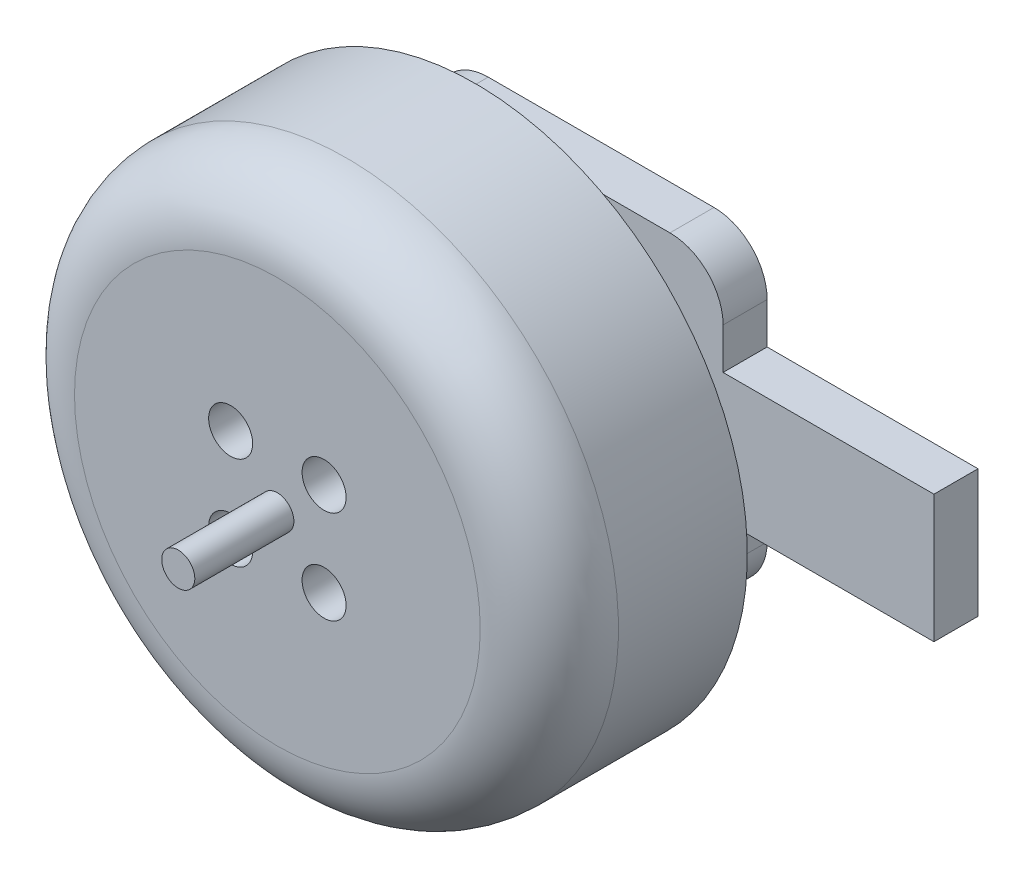
ISO-10303-21;
HEADER;
FILE_DESCRIPTION(('STEP AP214'),'2;1');
FILE_NAME('part.step','',(''),(''),'','','');
FILE_SCHEMA(('AUTOMOTIVE_DESIGN { 1 0 10303 214 1 1 1 1 }'));
ENDSEC;
DATA;
#1=APPLICATION_CONTEXT('core data for automotive mechanical design processes');
#2=APPLICATION_PROTOCOL_DEFINITION('international standard','automotive_design',2000,#1);
#3=PRODUCT_CONTEXT('',#1,'mechanical');
#4=PRODUCT('Part','Part','',(#3));
#5=PRODUCT_RELATED_PRODUCT_CATEGORY('part','',(#4));
#6=PRODUCT_DEFINITION_FORMATION('','',#4);
#7=PRODUCT_DEFINITION_CONTEXT('part definition',#1,'design');
#8=PRODUCT_DEFINITION('design','',#6,#7);
#9=PRODUCT_DEFINITION_SHAPE('','',#8);
#10=(LENGTH_UNIT() NAMED_UNIT(*) SI_UNIT(.MILLI.,.METRE.));
#11=(NAMED_UNIT(*) PLANE_ANGLE_UNIT() SI_UNIT($,.RADIAN.));
#12=(NAMED_UNIT(*) SI_UNIT($,.STERADIAN.) SOLID_ANGLE_UNIT());
#13=UNCERTAINTY_MEASURE_WITH_UNIT(LENGTH_MEASURE(1.E-05),#10,'distance_accuracy_value','');
#14=(GEOMETRIC_REPRESENTATION_CONTEXT(3) GLOBAL_UNCERTAINTY_ASSIGNED_CONTEXT((#13)) GLOBAL_UNIT_ASSIGNED_CONTEXT((#10,
#11,#12)) REPRESENTATION_CONTEXT('',''));
#15=CARTESIAN_POINT('',(0.,0.,0.));
#16=DIRECTION('',(0.,0.,1.));
#17=DIRECTION('',(1.,0.,0.));
#18=AXIS2_PLACEMENT_3D('',#15,#16,#17);
#19=CARTESIAN_POINT('',(3.1568256951202,0.,2.));
#20=DIRECTION('',(0.,0.,-1.));
#21=DIRECTION('',(-1.,0.,0.));
#22=AXIS2_PLACEMENT_3D('',#19,#20,#21);
#23=PLANE('',#22);
#24=CARTESIAN_POINT('',(0.,0.,2.));
#25=DIRECTION('',(0.,0.,-1.));
#26=DIRECTION('',(-1.,0.,0.));
#27=AXIS2_PLACEMENT_3D('',#24,#25,#26);
#28=CIRCLE('',#27,5.56365139024041);
#29=CARTESIAN_POINT('',(-3.27558257947967,-4.4971964107801,2.));
#30=VERTEX_POINT('',#29);
#31=CARTESIAN_POINT('',(-4.4971964107801,-3.27558257947967,2.));
#32=VERTEX_POINT('',#31);
#33=EDGE_CURVE('E12',#30,#32,#28,.T.);
#34=ORIENTED_EDGE('',*,*,#33,.T.);
#35=CARTESIAN_POINT('',(-4.24264068711928,-4.24264068711928,2.));
#36=DIRECTION('',(0.,0.,-1.));
#37=DIRECTION('',(-1.,0.,0.));
#38=AXIS2_PLACEMENT_3D('',#35,#36,#37);
#39=CIRCLE('',#38,1.);
#40=EDGE_CURVE('E30',#32,#30,#39,.T.);
#41=ORIENTED_EDGE('',*,*,#40,.T.);
#42=EDGE_LOOP('',(#34,#41));
#43=FACE_BOUND('',#42,.T.);
#44=ADVANCED_FACE('F20',(#43),#23,.T.);
#45=CARTESIAN_POINT('',(-4.4971964107801,3.27558257947967,2.));
#46=VERTEX_POINT('',#45);
#47=CARTESIAN_POINT('',(-3.27558257947967,4.4971964107801,2.));
#48=VERTEX_POINT('',#47);
#49=EDGE_CURVE('E31',#46,#48,#28,.T.);
#50=ORIENTED_EDGE('',*,*,#49,.T.);
#51=CARTESIAN_POINT('',(-4.24264068711928,4.24264068711928,2.));
#52=DIRECTION('',(0.,0.,-1.));
#53=DIRECTION('',(-1.,0.,0.));
#54=AXIS2_PLACEMENT_3D('',#51,#52,#53);
#55=CIRCLE('',#54,1.);
#56=EDGE_CURVE('E370',#48,#46,#55,.T.);
#57=ORIENTED_EDGE('',*,*,#56,.T.);
#58=EDGE_LOOP('',(#50,#57));
#59=FACE_BOUND('',#58,.T.);
#60=ADVANCED_FACE('F408',(#59),#23,.T.);
#61=CARTESIAN_POINT('',(3.27558257947967,4.4971964107801,2.));
#62=VERTEX_POINT('',#61);
#63=CARTESIAN_POINT('',(4.4971964107801,3.27558257947967,2.));
#64=VERTEX_POINT('',#63);
#65=EDGE_CURVE('E316',#62,#64,#28,.T.);
#66=ORIENTED_EDGE('',*,*,#65,.T.);
#67=CARTESIAN_POINT('',(4.24264068711928,4.24264068711928,2.));
#68=DIRECTION('',(0.,0.,-1.));
#69=DIRECTION('',(-1.,0.,0.));
#70=AXIS2_PLACEMENT_3D('',#67,#68,#69);
#71=CIRCLE('',#70,1.);
#72=EDGE_CURVE('E315',#64,#62,#71,.T.);
#73=ORIENTED_EDGE('',*,*,#72,.T.);
#74=EDGE_LOOP('',(#66,#73));
#75=FACE_BOUND('',#74,.T.);
#76=ADVANCED_FACE('F385',(#75),#23,.T.);
#77=CARTESIAN_POINT('',(4.4971964107801,-3.27558257947967,2.));
#78=VERTEX_POINT('',#77);
#79=CARTESIAN_POINT('',(3.27558257947967,-4.4971964107801,2.));
#80=VERTEX_POINT('',#79);
#81=EDGE_CURVE('E308',#78,#80,#28,.T.);
#82=ORIENTED_EDGE('',*,*,#81,.T.);
#83=CARTESIAN_POINT('',(4.24264068711928,-4.24264068711928,2.));
#84=DIRECTION('',(0.,0.,-1.));
#85=DIRECTION('',(-1.,0.,0.));
#86=AXIS2_PLACEMENT_3D('',#83,#84,#85);
#87=CIRCLE('',#86,1.);
#88=EDGE_CURVE('E298',#80,#78,#87,.T.);
#89=ORIENTED_EDGE('',*,*,#88,.T.);
#90=EDGE_LOOP('',(#82,#89));
#91=FACE_BOUND('',#90,.T.);
#92=ADVANCED_FACE('F22',(#91),#23,.T.);
#93=CARTESIAN_POINT('',(0.,0.,9.6));
#94=DIRECTION('',(0.,0.,-1.));
#95=DIRECTION('',(-1.,0.,0.));
#96=AXIS2_PLACEMENT_3D('',#93,#94,#95);
#97=CYLINDRICAL_SURFACE('',#96,5.56365139024041);
#98=ORIENTED_EDGE('',*,*,#49,.F.);
#99=EDGE_CURVE('E309',#32,#46,#28,.T.);
#100=ORIENTED_EDGE('',*,*,#99,.F.);
#101=ORIENTED_EDGE('',*,*,#33,.F.);
#102=EDGE_CURVE('E318',#80,#30,#28,.T.);
#103=ORIENTED_EDGE('',*,*,#102,.F.);
#104=ORIENTED_EDGE('',*,*,#81,.F.);
#105=EDGE_CURVE('E322',#64,#78,#28,.T.);
#106=ORIENTED_EDGE('',*,*,#105,.F.);
#107=ORIENTED_EDGE('',*,*,#65,.F.);
#108=EDGE_CURVE('E24',#48,#62,#28,.T.);
#109=ORIENTED_EDGE('',*,*,#108,.F.);
#110=EDGE_LOOP('',(#98,#100,#101,#103,#104,#106,#107,#109));
#111=FACE_BOUND('',#110,.T.);
#112=CARTESIAN_POINT('',(0.,0.,5.70970075204969));
#113=DIRECTION('',(0.,0.,-1.));
#114=DIRECTION('',(-1.,0.,0.));
#115=AXIS2_PLACEMENT_3D('',#112,#113,#114);
#116=CIRCLE('',#115,5.56365139024041);
#117=CARTESIAN_POINT('',(-5.56365139024041,0.,5.70970075204969));
#118=VERTEX_POINT('',#117);
#119=EDGE_CURVE('E329',#118,#118,#116,.T.);
#120=ORIENTED_EDGE('',*,*,#119,.T.);
#121=EDGE_LOOP('',(#120));
#122=FACE_BOUND('',#121,.T.);
#123=ADVANCED_FACE('F389',(#111,#122),#97,.T.);
#124=CARTESIAN_POINT('',(8.95682569512021,0.,5.70970075204969));
#125=DIRECTION('',(0.,0.,-1.));
#126=DIRECTION('',(-1.,0.,0.));
#127=AXIS2_PLACEMENT_3D('',#124,#125,#126);
#128=PLANE('',#127);
#129=CARTESIAN_POINT('',(0.,0.,5.70970075204969));
#130=DIRECTION('',(0.,0.,-1.));
#131=DIRECTION('',(-1.,0.,0.));
#132=AXIS2_PLACEMENT_3D('',#129,#130,#131);
#133=CIRCLE('',#132,12.35);
#134=CARTESIAN_POINT('',(-12.35,0.,5.70970075204969));
#135=VERTEX_POINT('',#134);
#136=EDGE_CURVE('E333',#135,#135,#133,.T.);
#137=ORIENTED_EDGE('',*,*,#136,.T.);
#138=EDGE_LOOP('',(#137));
#139=FACE_BOUND('',#138,.T.);
#140=ORIENTED_EDGE('',*,*,#119,.F.);
#141=EDGE_LOOP('',(#140));
#142=FACE_BOUND('',#141,.T.);
#143=ADVANCED_FACE('F417',(#139,#142),#128,.T.);
#144=CARTESIAN_POINT('',(0.,0.,9.6));
#145=DIRECTION('',(0.,0.,-1.));
#146=DIRECTION('',(-1.,0.,0.));
#147=AXIS2_PLACEMENT_3D('',#144,#145,#146);
#148=CYLINDRICAL_SURFACE('',#147,12.35);
#149=CARTESIAN_POINT('',(0.,0.,11.561522368915));
#150=DIRECTION('',(0.,0.,-1.));
#151=DIRECTION('',(-1.,0.,0.));
#152=AXIS2_PLACEMENT_3D('',#149,#150,#151);
#153=CIRCLE('',#152,12.35);
#154=CARTESIAN_POINT('',(-12.35,0.,11.561522368915));
#155=VERTEX_POINT('',#154);
#156=EDGE_CURVE('E338',#155,#155,#153,.T.);
#157=ORIENTED_EDGE('',*,*,#156,.T.);
#158=EDGE_LOOP('',(#157));
#159=FACE_BOUND('',#158,.T.);
#160=ORIENTED_EDGE('',*,*,#136,.F.);
#161=EDGE_LOOP('',(#160));
#162=FACE_BOUND('',#161,.T.);
#163=ADVANCED_FACE('F469',(#159,#162),#148,.T.);
#164=CARTESIAN_POINT('',(6.55,0.,14.7));
#165=DIRECTION('',(0.,0.,-1.));
#166=DIRECTION('',(-1.,0.,0.));
#167=AXIS2_PLACEMENT_3D('',#164,#165,#166);
#168=PLANE('',#167);
#169=CARTESIAN_POINT('',(-2.12132034355964,-2.12132034355965,14.7));
#170=DIRECTION('',(0.,0.,1.));
#171=DIRECTION('',(1.,0.,0.));
#172=AXIS2_PLACEMENT_3D('',#169,#170,#171);
#173=CIRCLE('',#172,1.);
#174=CARTESIAN_POINT('',(-1.12132034355964,-2.12132034355965,14.7));
#175=VERTEX_POINT('',#174);
#176=EDGE_CURVE('E351',#175,#175,#173,.T.);
#177=ORIENTED_EDGE('',*,*,#176,.F.);
#178=EDGE_LOOP('',(#177));
#179=FACE_BOUND('',#178,.T.);
#180=CARTESIAN_POINT('',(2.12132034355965,-2.12132034355964,14.7));
#181=DIRECTION('',(0.,0.,1.));
#182=DIRECTION('',(1.,0.,0.));
#183=AXIS2_PLACEMENT_3D('',#180,#181,#182);
#184=CIRCLE('',#183,1.);
#185=CARTESIAN_POINT('',(3.12132034355965,-2.12132034355964,14.7));
#186=VERTEX_POINT('',#185);
#187=EDGE_CURVE('E355',#186,#186,#184,.T.);
#188=ORIENTED_EDGE('',*,*,#187,.F.);
#189=EDGE_LOOP('',(#188));
#190=FACE_BOUND('',#189,.T.);
#191=CARTESIAN_POINT('',(2.12132034355965,2.12132034355965,14.7));
#192=DIRECTION('',(0.,0.,1.));
#193=DIRECTION('',(1.,0.,0.));
#194=AXIS2_PLACEMENT_3D('',#191,#192,#193);
#195=CIRCLE('',#194,1.);
#196=CARTESIAN_POINT('',(3.12132034355965,2.12132034355965,14.7));
#197=VERTEX_POINT('',#196);
#198=EDGE_CURVE('E812',#197,#197,#195,.T.);
#199=ORIENTED_EDGE('',*,*,#198,.F.);
#200=EDGE_LOOP('',(#199));
#201=FACE_BOUND('',#200,.T.);
#202=CARTESIAN_POINT('',(-2.12132034355965,2.12132034355965,14.7));
#203=DIRECTION('',(0.,0.,1.));
#204=DIRECTION('',(1.,0.,0.));
#205=AXIS2_PLACEMENT_3D('',#202,#203,#204);
#206=CIRCLE('',#205,1.);
#207=CARTESIAN_POINT('',(-1.12132034355965,2.12132034355965,14.7));
#208=VERTEX_POINT('',#207);
#209=EDGE_CURVE('E815',#208,#208,#206,.T.);
#210=ORIENTED_EDGE('',*,*,#209,.F.);
#211=EDGE_LOOP('',(#210));
#212=FACE_BOUND('',#211,.T.);
#213=CARTESIAN_POINT('',(0.,0.,14.7));
#214=DIRECTION('',(0.,0.,-1.));
#215=DIRECTION('',(-1.,0.,0.));
#216=AXIS2_PLACEMENT_3D('',#213,#214,#215);
#217=CIRCLE('',#216,9.21152236891497);
#218=CARTESIAN_POINT('',(-9.21152236891497,0.,14.7));
#219=VERTEX_POINT('',#218);
#220=EDGE_CURVE('E820',#219,#219,#217,.F.);
#221=ORIENTED_EDGE('',*,*,#220,.T.);
#222=EDGE_LOOP('',(#221));
#223=FACE_BOUND('',#222,.T.);
#224=CARTESIAN_POINT('',(0.,0.,14.7));
#225=DIRECTION('',(0.,0.,-1.));
#226=DIRECTION('',(-1.,0.,0.));
#227=AXIS2_PLACEMENT_3D('',#224,#225,#226);
#228=CIRCLE('',#227,0.75);
#229=CARTESIAN_POINT('',(-0.75,0.,14.7));
#230=VERTEX_POINT('',#229);
#231=EDGE_CURVE('E831',#230,#230,#228,.T.);
#232=ORIENTED_EDGE('',*,*,#231,.T.);
#233=EDGE_LOOP('',(#232));
#234=FACE_BOUND('',#233,.T.);
#235=ADVANCED_FACE('F465',(#179,#190,#201,#212,#223,#234),#168,.F.);
#236=CARTESIAN_POINT('',(0.,0.,9.6));
#237=DIRECTION('',(0.,0.,-1.));
#238=DIRECTION('',(-1.,0.,0.));
#239=AXIS2_PLACEMENT_3D('',#236,#237,#238);
#240=CYLINDRICAL_SURFACE('',#239,0.75);
#241=CARTESIAN_POINT('',(0.,0.,19.2));
#242=DIRECTION('',(0.,0.,-1.));
#243=DIRECTION('',(-1.,0.,0.));
#244=AXIS2_PLACEMENT_3D('',#241,#242,#243);
#245=CIRCLE('',#244,0.75);
#246=CARTESIAN_POINT('',(-0.75,0.,19.2));
#247=VERTEX_POINT('',#246);
#248=EDGE_CURVE('E835',#247,#247,#245,.T.);
#249=ORIENTED_EDGE('',*,*,#248,.T.);
#250=EDGE_LOOP('',(#249));
#251=FACE_BOUND('',#250,.T.);
#252=ORIENTED_EDGE('',*,*,#231,.F.);
#253=EDGE_LOOP('',(#252));
#254=FACE_BOUND('',#253,.T.);
#255=ADVANCED_FACE('F461',(#251,#254),#240,.T.);
#256=CARTESIAN_POINT('',(0.375,0.,19.2));
#257=DIRECTION('',(0.,0.,-1.));
#258=DIRECTION('',(-1.,0.,0.));
#259=AXIS2_PLACEMENT_3D('',#256,#257,#258);
#260=PLANE('',#259);
#261=ORIENTED_EDGE('',*,*,#248,.F.);
#262=EDGE_LOOP('',(#261));
#263=FACE_BOUND('',#262,.T.);
#264=ADVANCED_FACE('F457',(#263),#260,.F.);
#265=CARTESIAN_POINT('',(7.53957253526605,5.04276686507661,2.));
#266=DIRECTION('',(-1.,0.,0.));
#267=DIRECTION('',(0.,0.,1.));
#268=AXIS2_PLACEMENT_3D('',#265,#266,#267);
#269=PLANE('',#268);
#270=DIRECTION('',(0.,1.,0.));
#271=VECTOR('',#270,1.);
#272=CARTESIAN_POINT('',(7.53957253526605,5.04276686507661,0.));
#273=LINE('',#272,#271);
#274=CARTESIAN_POINT('',(7.53957253526605,2.9021502633841,0.));
#275=VERTEX_POINT('',#274);
#276=CARTESIAN_POINT('',(7.53957253526605,4.76916990439602,0.));
#277=VERTEX_POINT('',#276);
#278=EDGE_CURVE('E852',#275,#277,#273,.T.);
#279=ORIENTED_EDGE('',*,*,#278,.T.);
#280=DIRECTION('',(0.,0.,-1.));
#281=VECTOR('',#280,1.);
#282=CARTESIAN_POINT('',(7.53957253526605,4.76916990439602,2.));
#283=LINE('',#282,#281);
#284=CARTESIAN_POINT('',(7.53957253526605,4.76916990439602,2.));
#285=VERTEX_POINT('',#284);
#286=EDGE_CURVE('E854',#277,#285,#283,.F.);
#287=ORIENTED_EDGE('',*,*,#286,.T.);
#288=DIRECTION('',(0.,1.,0.));
#289=VECTOR('',#288,1.);
#290=CARTESIAN_POINT('',(7.53957253526605,5.04276686507661,2.));
#291=LINE('',#290,#289);
#292=CARTESIAN_POINT('',(7.53957253526605,2.9021502633841,2.));
#293=VERTEX_POINT('',#292);
#294=EDGE_CURVE('E856',#293,#285,#291,.T.);
#295=ORIENTED_EDGE('',*,*,#294,.F.);
#296=DIRECTION('',(0.,0.,-1.));
#297=VECTOR('',#296,1.);
#298=CARTESIAN_POINT('',(7.53957253526605,2.9021502633841,2.));
#299=LINE('',#298,#297);
#300=EDGE_CURVE('E859',#293,#275,#299,.T.);
#301=ORIENTED_EDGE('',*,*,#300,.T.);
#302=EDGE_LOOP('',(#279,#287,#295,#301));
#303=FACE_BOUND('',#302,.T.);
#304=ADVANCED_FACE('F453',(#303),#269,.F.);
#305=CARTESIAN_POINT('',(12.3270045748632,2.9021502633841,2.));
#306=DIRECTION('',(0.,1.,0.));
#307=DIRECTION('',(0.,0.,1.));
#308=AXIS2_PLACEMENT_3D('',#305,#306,#307);
#309=PLANE('',#308);
#310=DIRECTION('',(1.,0.,0.));
#311=VECTOR('',#310,1.);
#312=CARTESIAN_POINT('',(12.3270045748632,2.9021502633841,0.));
#313=LINE('',#312,#311);
#314=CARTESIAN_POINT('',(17.1144366144603,2.9021502633841,0.));
#315=VERTEX_POINT('',#314);
#316=EDGE_CURVE('E862',#275,#315,#313,.T.);
#317=ORIENTED_EDGE('',*,*,#316,.F.);
#318=ORIENTED_EDGE('',*,*,#300,.F.);
#319=DIRECTION('',(1.,0.,0.));
#320=VECTOR('',#319,1.);
#321=CARTESIAN_POINT('',(12.3270045748632,2.9021502633841,2.));
#322=LINE('',#321,#320);
#323=CARTESIAN_POINT('',(17.1144366144603,2.9021502633841,2.));
#324=VERTEX_POINT('',#323);
#325=EDGE_CURVE('E866',#293,#324,#322,.T.);
#326=ORIENTED_EDGE('',*,*,#325,.T.);
#327=DIRECTION('',(0.,0.,-1.));
#328=VECTOR('',#327,1.);
#329=CARTESIAN_POINT('',(17.1144366144603,2.9021502633841,2.));
#330=LINE('',#329,#328);
#331=EDGE_CURVE('E869',#324,#315,#330,.T.);
#332=ORIENTED_EDGE('',*,*,#331,.T.);
#333=EDGE_LOOP('',(#317,#318,#326,#332));
#334=FACE_BOUND('',#333,.T.);
#335=ADVANCED_FACE('F449',(#334),#309,.T.);
#336=CARTESIAN_POINT('',(17.1144366144603,0.,2.));
#337=DIRECTION('',(1.,0.,0.));
#338=DIRECTION('',(0.,0.,-1.));
#339=AXIS2_PLACEMENT_3D('',#336,#337,#338);
#340=PLANE('',#339);
#341=DIRECTION('',(0.,-1.,0.));
#342=VECTOR('',#341,1.);
#343=CARTESIAN_POINT('',(17.1144366144603,0.,0.));
#344=LINE('',#343,#342);
#345=CARTESIAN_POINT('',(17.1144366144603,-2.9021502633841,0.));
#346=VERTEX_POINT('',#345);
#347=EDGE_CURVE('E872',#315,#346,#344,.T.);
#348=ORIENTED_EDGE('',*,*,#347,.F.);
#349=ORIENTED_EDGE('',*,*,#331,.F.);
#350=DIRECTION('',(0.,-1.,0.));
#351=VECTOR('',#350,1.);
#352=CARTESIAN_POINT('',(17.1144366144603,0.,2.));
#353=LINE('',#352,#351);
#354=CARTESIAN_POINT('',(17.1144366144603,-2.9021502633841,2.));
#355=VERTEX_POINT('',#354);
#356=EDGE_CURVE('E876',#324,#355,#353,.T.);
#357=ORIENTED_EDGE('',*,*,#356,.T.);
#358=DIRECTION('',(0.,0.,-1.));
#359=VECTOR('',#358,1.);
#360=CARTESIAN_POINT('',(17.1144366144603,-2.9021502633841,2.));
#361=LINE('',#360,#359);
#362=EDGE_CURVE('E879',#355,#346,#361,.T.);
#363=ORIENTED_EDGE('',*,*,#362,.T.);
#364=EDGE_LOOP('',(#348,#349,#357,#363));
#365=FACE_BOUND('',#364,.T.);
#366=ADVANCED_FACE('F445',(#365),#340,.T.);
#367=CARTESIAN_POINT('',(12.3270045748632,-2.9021502633841,2.));
#368=DIRECTION('',(0.,1.,0.));
#369=DIRECTION('',(0.,0.,1.));
#370=AXIS2_PLACEMENT_3D('',#367,#368,#369);
#371=PLANE('',#370);
#372=DIRECTION('',(1.,0.,0.));
#373=VECTOR('',#372,1.);
#374=CARTESIAN_POINT('',(12.3270045748632,-2.9021502633841,0.));
#375=LINE('',#374,#373);
#376=CARTESIAN_POINT('',(7.53957253526605,-2.9021502633841,0.));
#377=VERTEX_POINT('',#376);
#378=EDGE_CURVE('E882',#377,#346,#375,.T.);
#379=ORIENTED_EDGE('',*,*,#378,.T.);
#380=ORIENTED_EDGE('',*,*,#362,.F.);
#381=DIRECTION('',(1.,0.,0.));
#382=VECTOR('',#381,1.);
#383=CARTESIAN_POINT('',(12.3270045748632,-2.9021502633841,2.));
#384=LINE('',#383,#382);
#385=CARTESIAN_POINT('',(7.53957253526605,-2.9021502633841,2.));
#386=VERTEX_POINT('',#385);
#387=EDGE_CURVE('E886',#386,#355,#384,.T.);
#388=ORIENTED_EDGE('',*,*,#387,.F.);
#389=DIRECTION('',(0.,0.,-1.));
#390=VECTOR('',#389,1.);
#391=CARTESIAN_POINT('',(7.53957253526605,-2.9021502633841,2.));
#392=LINE('',#391,#390);
#393=EDGE_CURVE('E254',#386,#377,#392,.T.);
#394=ORIENTED_EDGE('',*,*,#393,.T.);
#395=EDGE_LOOP('',(#379,#380,#388,#394));
#396=FACE_BOUND('',#395,.T.);
#397=ADVANCED_FACE('F442',(#396),#371,.F.);
#398=CARTESIAN_POINT('',(7.53957253526605,-5.04276686507661,2.));
#399=DIRECTION('',(-1.,0.,0.));
#400=DIRECTION('',(0.,0.,1.));
#401=AXIS2_PLACEMENT_3D('',#398,#399,#400);
#402=PLANE('',#401);
#403=DIRECTION('',(0.,1.,0.));
#404=VECTOR('',#403,1.);
#405=CARTESIAN_POINT('',(7.53957253526605,-5.04276686507661,2.));
#406=LINE('',#405,#404);
#407=CARTESIAN_POINT('',(7.53957253526605,-4.76916990439602,2.));
#408=VERTEX_POINT('',#407);
#409=EDGE_CURVE('E239',#408,#386,#406,.T.);
#410=ORIENTED_EDGE('',*,*,#409,.F.);
#411=DIRECTION('',(0.,0.,-1.));
#412=VECTOR('',#411,1.);
#413=CARTESIAN_POINT('',(7.53957253526605,-4.76916990439602,0.));
#414=LINE('',#413,#412);
#415=CARTESIAN_POINT('',(7.53957253526605,-4.76916990439602,0.));
#416=VERTEX_POINT('',#415);
#417=EDGE_CURVE('E244',#408,#416,#414,.T.);
#418=ORIENTED_EDGE('',*,*,#417,.T.);
#419=DIRECTION('',(0.,1.,0.));
#420=VECTOR('',#419,1.);
#421=CARTESIAN_POINT('',(7.53957253526605,-5.04276686507661,0.));
#422=LINE('',#421,#420);
#423=EDGE_CURVE('E250',#416,#377,#422,.T.);
#424=ORIENTED_EDGE('',*,*,#423,.T.);
#425=ORIENTED_EDGE('',*,*,#393,.F.);
#426=EDGE_LOOP('',(#410,#418,#424,#425));
#427=FACE_BOUND('',#426,.T.);
#428=ADVANCED_FACE('F438',(#427),#402,.F.);
#429=CARTESIAN_POINT('',(0.,-7.18338346676912,2.));
#430=DIRECTION('',(0.,-1.,0.));
#431=DIRECTION('',(0.,0.,-1.));
#432=AXIS2_PLACEMENT_3D('',#429,#430,#431);
#433=PLANE('',#432);
#434=DIRECTION('',(-1.,0.,0.));
#435=VECTOR('',#434,1.);
#436=CARTESIAN_POINT('',(0.,-7.18338346676912,0.));
#437=LINE('',#436,#435);
#438=CARTESIAN_POINT('',(5.12535897289295,-7.18338346676912,0.));
#439=VERTEX_POINT('',#438);
#440=CARTESIAN_POINT('',(-5.12535897289295,-7.18338346676912,0.));
#441=VERTEX_POINT('',#440);
#442=EDGE_CURVE('E256',#439,#441,#437,.T.);
#443=ORIENTED_EDGE('',*,*,#442,.F.);
#444=DIRECTION('',(0.,0.,-1.));
#445=VECTOR('',#444,1.);
#446=CARTESIAN_POINT('',(5.12535897289295,-7.18338346676912,2.));
#447=LINE('',#446,#445);
#448=CARTESIAN_POINT('',(5.12535897289295,-7.18338346676912,2.));
#449=VERTEX_POINT('',#448);
#450=EDGE_CURVE('E274',#439,#449,#447,.F.);
#451=ORIENTED_EDGE('',*,*,#450,.T.);
#452=DIRECTION('',(-1.,0.,0.));
#453=VECTOR('',#452,1.);
#454=CARTESIAN_POINT('',(0.,-7.18338346676912,2.));
#455=LINE('',#454,#453);
#456=CARTESIAN_POINT('',(-5.12535897289295,-7.18338346676912,2.));
#457=VERTEX_POINT('',#456);
#458=EDGE_CURVE('E240',#449,#457,#455,.T.);
#459=ORIENTED_EDGE('',*,*,#458,.T.);
#460=DIRECTION('',(0.,0.,-1.));
#461=VECTOR('',#460,1.);
#462=CARTESIAN_POINT('',(-5.12535897289295,-7.18338346676912,2.));
#463=LINE('',#462,#461);
#464=EDGE_CURVE('E279',#457,#441,#463,.T.);
#465=ORIENTED_EDGE('',*,*,#464,.T.);
#466=EDGE_LOOP('',(#443,#451,#459,#465));
#467=FACE_BOUND('',#466,.T.);
#468=ADVANCED_FACE('F432',(#467),#433,.T.);
#469=CARTESIAN_POINT('',(-7.53957253526605,0.,2.));
#470=DIRECTION('',(-1.,0.,0.));
#471=DIRECTION('',(0.,0.,1.));
#472=AXIS2_PLACEMENT_3D('',#469,#470,#471);
#473=PLANE('',#472);
#474=DIRECTION('',(0.,1.,0.));
#475=VECTOR('',#474,1.);
#476=CARTESIAN_POINT('',(-7.53957253526605,0.,2.));
#477=LINE('',#476,#475);
#478=CARTESIAN_POINT('',(-7.53957253526605,-4.76916990439602,2.));
#479=VERTEX_POINT('',#478);
#480=CARTESIAN_POINT('',(-7.53957253526605,4.76916990439602,2.));
#481=VERTEX_POINT('',#480);
#482=EDGE_CURVE('E281',#479,#481,#477,.T.);
#483=ORIENTED_EDGE('',*,*,#482,.T.);
#484=DIRECTION('',(0.,0.,-1.));
#485=VECTOR('',#484,1.);
#486=CARTESIAN_POINT('',(-7.53957253526605,4.76916990439602,0.));
#487=LINE('',#486,#485);
#488=CARTESIAN_POINT('',(-7.53957253526605,4.76916990439602,0.));
#489=VERTEX_POINT('',#488);
#490=EDGE_CURVE('E159',#481,#489,#487,.T.);
#491=ORIENTED_EDGE('',*,*,#490,.T.);
#492=DIRECTION('',(0.,1.,0.));
#493=VECTOR('',#492,1.);
#494=CARTESIAN_POINT('',(-7.53957253526605,0.,0.));
#495=LINE('',#494,#493);
#496=CARTESIAN_POINT('',(-7.53957253526605,-4.76916990439602,0.));
#497=VERTEX_POINT('',#496);
#498=EDGE_CURVE('E287',#497,#489,#495,.T.);
#499=ORIENTED_EDGE('',*,*,#498,.F.);
#500=DIRECTION('',(0.,0.,-1.));
#501=VECTOR('',#500,1.);
#502=CARTESIAN_POINT('',(-7.53957253526605,-4.76916990439602,2.));
#503=LINE('',#502,#501);
#504=EDGE_CURVE('E290',#497,#479,#503,.F.);
#505=ORIENTED_EDGE('',*,*,#504,.T.);
#506=EDGE_LOOP('',(#483,#491,#499,#505));
#507=FACE_BOUND('',#506,.T.);
#508=ADVANCED_FACE('F422',(#507),#473,.T.);
#509=CARTESIAN_POINT('',(4.24264068711928,-4.24264068711928,2.));
#510=DIRECTION('',(0.,0.,-1.));
#511=DIRECTION('',(-1.,0.,0.));
#512=AXIS2_PLACEMENT_3D('',#509,#510,#511);
#513=CYLINDRICAL_SURFACE('',#512,1.);
#514=EDGE_CURVE('E292',#78,#80,#87,.T.);
#515=ORIENTED_EDGE('',*,*,#514,.F.);
#516=ORIENTED_EDGE('',*,*,#88,.F.);
#517=EDGE_LOOP('',(#515,#516));
#518=FACE_BOUND('',#517,.T.);
#519=CARTESIAN_POINT('',(4.24264068711928,-4.24264068711928,0.));
#520=DIRECTION('',(0.,0.,-1.));
#521=DIRECTION('',(-1.,0.,0.));
#522=AXIS2_PLACEMENT_3D('',#519,#520,#521);
#523=CIRCLE('',#522,1.);
#524=CARTESIAN_POINT('',(3.24264068711928,-4.24264068711928,0.));
#525=VERTEX_POINT('',#524);
#526=EDGE_CURVE('E201',#525,#525,#523,.T.);
#527=ORIENTED_EDGE('',*,*,#526,.T.);
#528=EDGE_LOOP('',(#527));
#529=FACE_BOUND('',#528,.T.);
#530=ADVANCED_FACE('F419',(#518,#529),#513,.F.);
#531=CARTESIAN_POINT('',(4.24264068711928,4.24264068711928,2.));
#532=DIRECTION('',(0.,0.,-1.));
#533=DIRECTION('',(-1.,0.,0.));
#534=AXIS2_PLACEMENT_3D('',#531,#532,#533);
#535=CYLINDRICAL_SURFACE('',#534,1.);
#536=EDGE_CURVE('E200',#62,#64,#71,.T.);
#537=ORIENTED_EDGE('',*,*,#536,.F.);
#538=ORIENTED_EDGE('',*,*,#72,.F.);
#539=EDGE_LOOP('',(#537,#538));
#540=FACE_BOUND('',#539,.T.);
#541=CARTESIAN_POINT('',(4.24264068711928,4.24264068711928,0.));
#542=DIRECTION('',(0.,0.,-1.));
#543=DIRECTION('',(-1.,0.,0.));
#544=AXIS2_PLACEMENT_3D('',#541,#542,#543);
#545=CIRCLE('',#544,1.);
#546=CARTESIAN_POINT('',(3.24264068711928,4.24264068711928,0.));
#547=VERTEX_POINT('',#546);
#548=EDGE_CURVE('E195',#547,#547,#545,.T.);
#549=ORIENTED_EDGE('',*,*,#548,.T.);
#550=EDGE_LOOP('',(#549));
#551=FACE_BOUND('',#550,.T.);
#552=ADVANCED_FACE('F391',(#540,#551),#535,.F.);
#553=CARTESIAN_POINT('',(-4.24264068711928,4.24264068711928,2.));
#554=DIRECTION('',(0.,0.,-1.));
#555=DIRECTION('',(-1.,0.,0.));
#556=AXIS2_PLACEMENT_3D('',#553,#554,#555);
#557=CYLINDRICAL_SURFACE('',#556,1.);
#558=ORIENTED_EDGE('',*,*,#56,.F.);
#559=EDGE_CURVE('E194',#46,#48,#55,.T.);
#560=ORIENTED_EDGE('',*,*,#559,.F.);
#561=EDGE_LOOP('',(#558,#560));
#562=FACE_BOUND('',#561,.T.);
#563=CARTESIAN_POINT('',(-4.24264068711928,4.24264068711928,0.));
#564=DIRECTION('',(0.,0.,-1.));
#565=DIRECTION('',(-1.,0.,0.));
#566=AXIS2_PLACEMENT_3D('',#563,#564,#565);
#567=CIRCLE('',#566,1.);
#568=CARTESIAN_POINT('',(-5.24264068711928,4.24264068711928,0.));
#569=VERTEX_POINT('',#568);
#570=EDGE_CURVE('E189',#569,#569,#567,.T.);
#571=ORIENTED_EDGE('',*,*,#570,.T.);
#572=EDGE_LOOP('',(#571));
#573=FACE_BOUND('',#572,.T.);
#574=ADVANCED_FACE('F430',(#562,#573),#557,.F.);
#575=CARTESIAN_POINT('',(-4.24264068711928,-4.24264068711928,2.));
#576=DIRECTION('',(0.,0.,-1.));
#577=DIRECTION('',(-1.,0.,0.));
#578=AXIS2_PLACEMENT_3D('',#575,#576,#577);
#579=CYLINDRICAL_SURFACE('',#578,1.);
#580=ORIENTED_EDGE('',*,*,#40,.F.);
#581=EDGE_CURVE('E187',#30,#32,#39,.T.);
#582=ORIENTED_EDGE('',*,*,#581,.F.);
#583=EDGE_LOOP('',(#580,#582));
#584=FACE_BOUND('',#583,.T.);
#585=CARTESIAN_POINT('',(-4.24264068711928,-4.24264068711928,0.));
#586=DIRECTION('',(0.,0.,-1.));
#587=DIRECTION('',(-1.,0.,0.));
#588=AXIS2_PLACEMENT_3D('',#585,#586,#587);
#589=CIRCLE('',#588,1.);
#590=CARTESIAN_POINT('',(-5.24264068711928,-4.24264068711928,0.));
#591=VERTEX_POINT('',#590);
#592=EDGE_CURVE('E155',#591,#591,#589,.T.);
#593=ORIENTED_EDGE('',*,*,#592,.T.);
#594=EDGE_LOOP('',(#593));
#595=FACE_BOUND('',#594,.T.);
#596=ADVANCED_FACE('F405',(#584,#595),#579,.F.);
#597=CARTESIAN_POINT('',(0.,7.18338346676912,2.));
#598=DIRECTION('',(0.,-1.,0.));
#599=DIRECTION('',(0.,0.,-1.));
#600=AXIS2_PLACEMENT_3D('',#597,#598,#599);
#601=PLANE('',#600);
#602=DIRECTION('',(-1.,0.,0.));
#603=VECTOR('',#602,1.);
#604=CARTESIAN_POINT('',(0.,7.18338346676912,2.));
#605=LINE('',#604,#603);
#606=CARTESIAN_POINT('',(5.12535897289295,7.18338346676912,2.));
#607=VERTEX_POINT('',#606);
#608=CARTESIAN_POINT('',(-5.12535897289295,7.18338346676912,2.));
#609=VERTEX_POINT('',#608);
#610=EDGE_CURVE('E133',#607,#609,#605,.T.);
#611=ORIENTED_EDGE('',*,*,#610,.F.);
#612=DIRECTION('',(0.,0.,-1.));
#613=VECTOR('',#612,1.);
#614=CARTESIAN_POINT('',(5.12535897289295,7.18338346676912,2.));
#615=LINE('',#614,#613);
#616=CARTESIAN_POINT('',(5.12535897289295,7.18338346676912,0.));
#617=VERTEX_POINT('',#616);
#618=EDGE_CURVE('E156',#607,#617,#615,.T.);
#619=ORIENTED_EDGE('',*,*,#618,.T.);
#620=DIRECTION('',(-1.,0.,0.));
#621=VECTOR('',#620,1.);
#622=CARTESIAN_POINT('',(0.,7.18338346676912,0.));
#623=LINE('',#622,#621);
#624=CARTESIAN_POINT('',(-5.12535897289295,7.18338346676912,0.));
#625=VERTEX_POINT('',#624);
#626=EDGE_CURVE('E136',#617,#625,#623,.T.);
#627=ORIENTED_EDGE('',*,*,#626,.T.);
#628=DIRECTION('',(0.,0.,-1.));
#629=VECTOR('',#628,1.);
#630=CARTESIAN_POINT('',(-5.12535897289295,7.18338346676912,2.));
#631=LINE('',#630,#629);
#632=EDGE_CURVE('E130',#625,#609,#631,.F.);
#633=ORIENTED_EDGE('',*,*,#632,.T.);
#634=EDGE_LOOP('',(#611,#619,#627,#633));
#635=FACE_BOUND('',#634,.T.);
#636=ADVANCED_FACE('F132',(#635),#601,.F.);
#637=CARTESIAN_POINT('',(4.78743203959714,0.,2.));
#638=DIRECTION('',(0.,0.,-1.));
#639=DIRECTION('',(1.,0.,0.));
#640=AXIS2_PLACEMENT_3D('',#637,#638,#639);
#641=PLANE('',#640);
#642=ORIENTED_EDGE('',*,*,#294,.T.);
#643=CARTESIAN_POINT('',(5.12535897289295,4.76916990439602,2.));
#644=DIRECTION('',(0.,0.,-1.));
#645=DIRECTION('',(-1.,0.,0.));
#646=AXIS2_PLACEMENT_3D('',#643,#644,#645);
#647=CIRCLE('',#646,2.41421356237309);
#648=EDGE_CURVE('E142',#285,#607,#647,.F.);
#649=ORIENTED_EDGE('',*,*,#648,.T.);
#650=ORIENTED_EDGE('',*,*,#610,.T.);
#651=CARTESIAN_POINT('',(-5.12535897289295,4.76916990439602,2.));
#652=DIRECTION('',(0.,0.,-1.));
#653=DIRECTION('',(-1.,0.,0.));
#654=AXIS2_PLACEMENT_3D('',#651,#652,#653);
#655=CIRCLE('',#654,2.41421356237309);
#656=EDGE_CURVE('E150',#609,#481,#655,.F.);
#657=ORIENTED_EDGE('',*,*,#656,.T.);
#658=ORIENTED_EDGE('',*,*,#482,.F.);
#659=CARTESIAN_POINT('',(-5.12535897289295,-4.76916990439602,2.));
#660=DIRECTION('',(0.,0.,-1.));
#661=DIRECTION('',(-1.,0.,0.));
#662=AXIS2_PLACEMENT_3D('',#659,#660,#661);
#663=CIRCLE('',#662,2.41421356237309);
#664=EDGE_CURVE('E161',#479,#457,#663,.F.);
#665=ORIENTED_EDGE('',*,*,#664,.T.);
#666=ORIENTED_EDGE('',*,*,#458,.F.);
#667=CARTESIAN_POINT('',(5.12535897289295,-4.76916990439602,2.));
#668=DIRECTION('',(0.,0.,-1.));
#669=DIRECTION('',(-1.,0.,0.));
#670=AXIS2_PLACEMENT_3D('',#667,#668,#669);
#671=CIRCLE('',#670,2.41421356237309);
#672=EDGE_CURVE('E168',#449,#408,#671,.F.);
#673=ORIENTED_EDGE('',*,*,#672,.T.);
#674=ORIENTED_EDGE('',*,*,#409,.T.);
#675=ORIENTED_EDGE('',*,*,#387,.T.);
#676=ORIENTED_EDGE('',*,*,#356,.F.);
#677=ORIENTED_EDGE('',*,*,#325,.F.);
#678=EDGE_LOOP('',(#642,#649,#650,#657,#658,#665,#666,#673,#674,#675,#676,#677));
#679=FACE_BOUND('',#678,.T.);
#680=ORIENTED_EDGE('',*,*,#559,.T.);
#681=ORIENTED_EDGE('',*,*,#108,.T.);
#682=ORIENTED_EDGE('',*,*,#536,.T.);
#683=ORIENTED_EDGE('',*,*,#105,.T.);
#684=ORIENTED_EDGE('',*,*,#514,.T.);
#685=ORIENTED_EDGE('',*,*,#102,.T.);
#686=ORIENTED_EDGE('',*,*,#581,.T.);
#687=ORIENTED_EDGE('',*,*,#99,.T.);
#688=EDGE_LOOP('',(#680,#681,#682,#683,#684,#685,#686,#687));
#689=FACE_BOUND('',#688,.T.);
#690=ADVANCED_FACE('F147',(#679,#689),#641,.F.);
#691=CARTESIAN_POINT('',(0.375,0.,0.));
#692=DIRECTION('',(0.,0.,-1.));
#693=DIRECTION('',(-1.,0.,0.));
#694=AXIS2_PLACEMENT_3D('',#691,#692,#693);
#695=PLANE('',#694);
#696=ORIENTED_EDGE('',*,*,#626,.F.);
#697=CARTESIAN_POINT('',(5.12535897289295,4.76916990439602,0.));
#698=DIRECTION('',(0.,0.,-1.));
#699=DIRECTION('',(-1.,0.,0.));
#700=AXIS2_PLACEMENT_3D('',#697,#698,#699);
#701=CIRCLE('',#700,2.41421356237309);
#702=EDGE_CURVE('E229',#617,#277,#701,.T.);
#703=ORIENTED_EDGE('',*,*,#702,.T.);
#704=ORIENTED_EDGE('',*,*,#278,.F.);
#705=ORIENTED_EDGE('',*,*,#316,.T.);
#706=ORIENTED_EDGE('',*,*,#347,.T.);
#707=ORIENTED_EDGE('',*,*,#378,.F.);
#708=ORIENTED_EDGE('',*,*,#423,.F.);
#709=CARTESIAN_POINT('',(5.12535897289295,-4.76916990439602,0.));
#710=DIRECTION('',(0.,0.,-1.));
#711=DIRECTION('',(-1.,0.,0.));
#712=AXIS2_PLACEMENT_3D('',#709,#710,#711);
#713=CIRCLE('',#712,2.41421356237309);
#714=EDGE_CURVE('E225',#416,#439,#713,.T.);
#715=ORIENTED_EDGE('',*,*,#714,.T.);
#716=ORIENTED_EDGE('',*,*,#442,.T.);
#717=CARTESIAN_POINT('',(-5.12535897289295,-4.76916990439602,0.));
#718=DIRECTION('',(0.,0.,-1.));
#719=DIRECTION('',(-1.,0.,0.));
#720=AXIS2_PLACEMENT_3D('',#717,#718,#719);
#721=CIRCLE('',#720,2.41421356237309);
#722=EDGE_CURVE('E221',#441,#497,#721,.T.);
#723=ORIENTED_EDGE('',*,*,#722,.T.);
#724=ORIENTED_EDGE('',*,*,#498,.T.);
#725=CARTESIAN_POINT('',(-5.12535897289295,4.76916990439602,0.));
#726=DIRECTION('',(0.,0.,-1.));
#727=DIRECTION('',(-1.,0.,0.));
#728=AXIS2_PLACEMENT_3D('',#725,#726,#727);
#729=CIRCLE('',#728,2.41421356237309);
#730=EDGE_CURVE('E215',#489,#625,#729,.T.);
#731=ORIENTED_EDGE('',*,*,#730,.T.);
#732=EDGE_LOOP('',(#696,#703,#704,#705,#706,#707,#708,#715,#716,#723,#724,#731));
#733=FACE_BOUND('',#732,.T.);
#734=ORIENTED_EDGE('',*,*,#592,.F.);
#735=EDGE_LOOP('',(#734));
#736=FACE_BOUND('',#735,.T.);
#737=ORIENTED_EDGE('',*,*,#570,.F.);
#738=EDGE_LOOP('',(#737));
#739=FACE_BOUND('',#738,.T.);
#740=ORIENTED_EDGE('',*,*,#548,.F.);
#741=EDGE_LOOP('',(#740));
#742=FACE_BOUND('',#741,.T.);
#743=ORIENTED_EDGE('',*,*,#526,.F.);
#744=EDGE_LOOP('',(#743));
#745=FACE_BOUND('',#744,.T.);
#746=ADVANCED_FACE('F395',(#733,#736,#739,#742,#745),#695,.T.);
#747=CARTESIAN_POINT('',(5.12535897289295,4.76916990439602,2.));
#748=DIRECTION('',(0.,0.,-1.));
#749=DIRECTION('',(-1.,0.,0.));
#750=AXIS2_PLACEMENT_3D('',#747,#748,#749);
#751=CYLINDRICAL_SURFACE('',#750,2.41421356237309);
#752=ORIENTED_EDGE('',*,*,#648,.F.);
#753=ORIENTED_EDGE('',*,*,#286,.F.);
#754=ORIENTED_EDGE('',*,*,#702,.F.);
#755=ORIENTED_EDGE('',*,*,#618,.F.);
#756=EDGE_LOOP('',(#752,#753,#754,#755));
#757=FACE_BOUND('',#756,.T.);
#758=ADVANCED_FACE('F402',(#757),#751,.T.);
#759=CARTESIAN_POINT('',(-5.12535897289295,4.76916990439602,2.));
#760=DIRECTION('',(0.,0.,1.));
#761=DIRECTION('',(1.,0.,0.));
#762=AXIS2_PLACEMENT_3D('',#759,#760,#761);
#763=CYLINDRICAL_SURFACE('',#762,2.41421356237309);
#764=ORIENTED_EDGE('',*,*,#656,.F.);
#765=ORIENTED_EDGE('',*,*,#632,.F.);
#766=ORIENTED_EDGE('',*,*,#730,.F.);
#767=ORIENTED_EDGE('',*,*,#490,.F.);
#768=EDGE_LOOP('',(#764,#765,#766,#767));
#769=FACE_BOUND('',#768,.T.);
#770=ADVANCED_FACE('F158',(#769),#763,.T.);
#771=CARTESIAN_POINT('',(5.12535897289295,-4.76916990439602,2.));
#772=DIRECTION('',(0.,0.,1.));
#773=DIRECTION('',(1.,0.,0.));
#774=AXIS2_PLACEMENT_3D('',#771,#772,#773);
#775=CYLINDRICAL_SURFACE('',#774,2.41421356237309);
#776=ORIENTED_EDGE('',*,*,#672,.F.);
#777=ORIENTED_EDGE('',*,*,#450,.F.);
#778=ORIENTED_EDGE('',*,*,#714,.F.);
#779=ORIENTED_EDGE('',*,*,#417,.F.);
#780=EDGE_LOOP('',(#776,#777,#778,#779));
#781=FACE_BOUND('',#780,.T.);
#782=ADVANCED_FACE('F245',(#781),#775,.T.);
#783=CARTESIAN_POINT('',(-5.12535897289295,-4.76916990439602,2.));
#784=DIRECTION('',(0.,0.,-1.));
#785=DIRECTION('',(-1.,0.,0.));
#786=AXIS2_PLACEMENT_3D('',#783,#784,#785);
#787=CYLINDRICAL_SURFACE('',#786,2.41421356237309);
#788=ORIENTED_EDGE('',*,*,#664,.F.);
#789=ORIENTED_EDGE('',*,*,#504,.F.);
#790=ORIENTED_EDGE('',*,*,#722,.F.);
#791=ORIENTED_EDGE('',*,*,#464,.F.);
#792=EDGE_LOOP('',(#788,#789,#790,#791));
#793=FACE_BOUND('',#792,.T.);
#794=ADVANCED_FACE('F579',(#793),#787,.T.);
#795=CARTESIAN_POINT('',(0.,0.,11.561522368915));
#796=DIRECTION('',(0.,0.,-1.));
#797=DIRECTION('',(-1.,0.,0.));
#798=AXIS2_PLACEMENT_3D('',#795,#796,#797);
#799=TOROIDAL_SURFACE('',#798,9.21152236891497,3.13847763108503);
#800=ORIENTED_EDGE('',*,*,#220,.F.);
#801=EDGE_LOOP('',(#800));
#802=FACE_BOUND('',#801,.T.);
#803=ORIENTED_EDGE('',*,*,#156,.F.);
#804=EDGE_LOOP('',(#803));
#805=FACE_BOUND('',#804,.T.);
#806=ADVANCED_FACE('F587',(#802,#805),#799,.T.);
#807=CARTESIAN_POINT('',(-2.12132034355965,2.12132034355965,10.7));
#808=DIRECTION('',(0.,0.,1.));
#809=DIRECTION('',(1.,0.,0.));
#810=AXIS2_PLACEMENT_3D('',#807,#808,#809);
#811=CYLINDRICAL_SURFACE('',#810,1.);
#812=CARTESIAN_POINT('',(-2.12132034355965,2.12132034355965,10.7));
#813=DIRECTION('',(0.,0.,1.));
#814=DIRECTION('',(1.,0.,0.));
#815=AXIS2_PLACEMENT_3D('',#812,#813,#814);
#816=CIRCLE('',#815,1.);
#817=CARTESIAN_POINT('',(-1.12132034355965,2.12132034355965,10.7));
#818=VERTEX_POINT('',#817);
#819=EDGE_CURVE('E210',#818,#818,#816,.T.);
#820=ORIENTED_EDGE('',*,*,#819,.F.);
#821=EDGE_LOOP('',(#820));
#822=FACE_BOUND('',#821,.T.);
#823=ORIENTED_EDGE('',*,*,#209,.T.);
#824=EDGE_LOOP('',(#823));
#825=FACE_BOUND('',#824,.T.);
#826=ADVANCED_FACE('F596',(#822,#825),#811,.F.);
#827=CARTESIAN_POINT('',(0.,0.,10.7));
#828=DIRECTION('',(0.,0.,1.));
#829=DIRECTION('',(1.,0.,0.));
#830=AXIS2_PLACEMENT_3D('',#827,#828,#829);
#831=PLANE('',#830);
#832=ORIENTED_EDGE('',*,*,#819,.T.);
#833=EDGE_LOOP('',(#832));
#834=FACE_BOUND('',#833,.T.);
#835=ADVANCED_FACE('F605',(#834),#831,.T.);
#836=CARTESIAN_POINT('',(2.12132034355965,2.12132034355965,10.7));
#837=DIRECTION('',(0.,0.,1.));
#838=DIRECTION('',(1.,0.,0.));
#839=AXIS2_PLACEMENT_3D('',#836,#837,#838);
#840=CYLINDRICAL_SURFACE('',#839,1.);
#841=CARTESIAN_POINT('',(2.12132034355965,2.12132034355965,10.7));
#842=DIRECTION('',(0.,0.,1.));
#843=DIRECTION('',(1.,0.,0.));
#844=AXIS2_PLACEMENT_3D('',#841,#842,#843);
#845=CIRCLE('',#844,1.);
#846=CARTESIAN_POINT('',(3.12132034355965,2.12132034355965,10.7));
#847=VERTEX_POINT('',#846);
#848=EDGE_CURVE('E216',#847,#847,#845,.T.);
#849=ORIENTED_EDGE('',*,*,#848,.F.);
#850=EDGE_LOOP('',(#849));
#851=FACE_BOUND('',#850,.T.);
#852=ORIENTED_EDGE('',*,*,#198,.T.);
#853=EDGE_LOOP('',(#852));
#854=FACE_BOUND('',#853,.T.);
#855=ADVANCED_FACE('F614',(#851,#854),#840,.F.);
#856=CARTESIAN_POINT('',(0.,0.,10.7));
#857=DIRECTION('',(0.,0.,1.));
#858=DIRECTION('',(1.,0.,0.));
#859=AXIS2_PLACEMENT_3D('',#856,#857,#858);
#860=PLANE('',#859);
#861=ORIENTED_EDGE('',*,*,#848,.T.);
#862=EDGE_LOOP('',(#861));
#863=FACE_BOUND('',#862,.T.);
#864=ADVANCED_FACE('F623',(#863),#860,.T.);
#865=CARTESIAN_POINT('',(2.12132034355965,-2.12132034355964,10.7));
#866=DIRECTION('',(0.,0.,1.));
#867=DIRECTION('',(1.,0.,0.));
#868=AXIS2_PLACEMENT_3D('',#865,#866,#867);
#869=CYLINDRICAL_SURFACE('',#868,1.);
#870=CARTESIAN_POINT('',(2.12132034355965,-2.12132034355964,10.7));
#871=DIRECTION('',(0.,0.,1.));
#872=DIRECTION('',(1.,0.,0.));
#873=AXIS2_PLACEMENT_3D('',#870,#871,#872);
#874=CIRCLE('',#873,1.);
#875=CARTESIAN_POINT('',(3.12132034355965,-2.12132034355964,10.7));
#876=VERTEX_POINT('',#875);
#877=EDGE_CURVE('E800',#876,#876,#874,.T.);
#878=ORIENTED_EDGE('',*,*,#877,.F.);
#879=EDGE_LOOP('',(#878));
#880=FACE_BOUND('',#879,.T.);
#881=ORIENTED_EDGE('',*,*,#187,.T.);
#882=EDGE_LOOP('',(#881));
#883=FACE_BOUND('',#882,.T.);
#884=ADVANCED_FACE('F632',(#880,#883),#869,.F.);
#885=CARTESIAN_POINT('',(0.,0.,10.7));
#886=DIRECTION('',(0.,0.,1.));
#887=DIRECTION('',(1.,0.,0.));
#888=AXIS2_PLACEMENT_3D('',#885,#886,#887);
#889=PLANE('',#888);
#890=ORIENTED_EDGE('',*,*,#877,.T.);
#891=EDGE_LOOP('',(#890));
#892=FACE_BOUND('',#891,.T.);
#893=ADVANCED_FACE('F641',(#892),#889,.T.);
#894=CARTESIAN_POINT('',(-2.12132034355964,-2.12132034355965,10.7));
#895=DIRECTION('',(0.,0.,1.));
#896=DIRECTION('',(1.,0.,0.));
#897=AXIS2_PLACEMENT_3D('',#894,#895,#896);
#898=CYLINDRICAL_SURFACE('',#897,1.);
#899=CARTESIAN_POINT('',(-2.12132034355964,-2.12132034355965,10.7));
#900=DIRECTION('',(0.,0.,1.));
#901=DIRECTION('',(1.,0.,0.));
#902=AXIS2_PLACEMENT_3D('',#899,#900,#901);
#903=CIRCLE('',#902,1.);
#904=CARTESIAN_POINT('',(-1.12132034355964,-2.12132034355965,10.7));
#905=VERTEX_POINT('',#904);
#906=EDGE_CURVE('E798',#905,#905,#903,.T.);
#907=ORIENTED_EDGE('',*,*,#906,.F.);
#908=EDGE_LOOP('',(#907));
#909=FACE_BOUND('',#908,.T.);
#910=ORIENTED_EDGE('',*,*,#176,.T.);
#911=EDGE_LOOP('',(#910));
#912=FACE_BOUND('',#911,.T.);
#913=ADVANCED_FACE('F650',(#909,#912),#898,.F.);
#914=CARTESIAN_POINT('',(0.,0.,10.7));
#915=DIRECTION('',(0.,0.,1.));
#916=DIRECTION('',(1.,0.,0.));
#917=AXIS2_PLACEMENT_3D('',#914,#915,#916);
#918=PLANE('',#917);
#919=ORIENTED_EDGE('',*,*,#906,.T.);
#920=EDGE_LOOP('',(#919));
#921=FACE_BOUND('',#920,.T.);
#922=ADVANCED_FACE('F659',(#921),#918,.T.);
#923=CLOSED_SHELL('',(#44,#60,#76,#92,#123,#143,#163,#235,#255,#264,#304,#335,#366,#397,#428,
#468,#508,#530,#552,#574,#596,#636,#690,#746,#758,#770,#782,#794,#806,#826,#835,#855,#864,#884,
#893,#913,#922));
#924=MANIFOLD_SOLID_BREP('B1',#923);
#925=ADVANCED_BREP_SHAPE_REPRESENTATION('',(#18,#924),#14);
#926=SHAPE_DEFINITION_REPRESENTATION(#9,#925);
ENDSEC;
END-ISO-10303-21;
